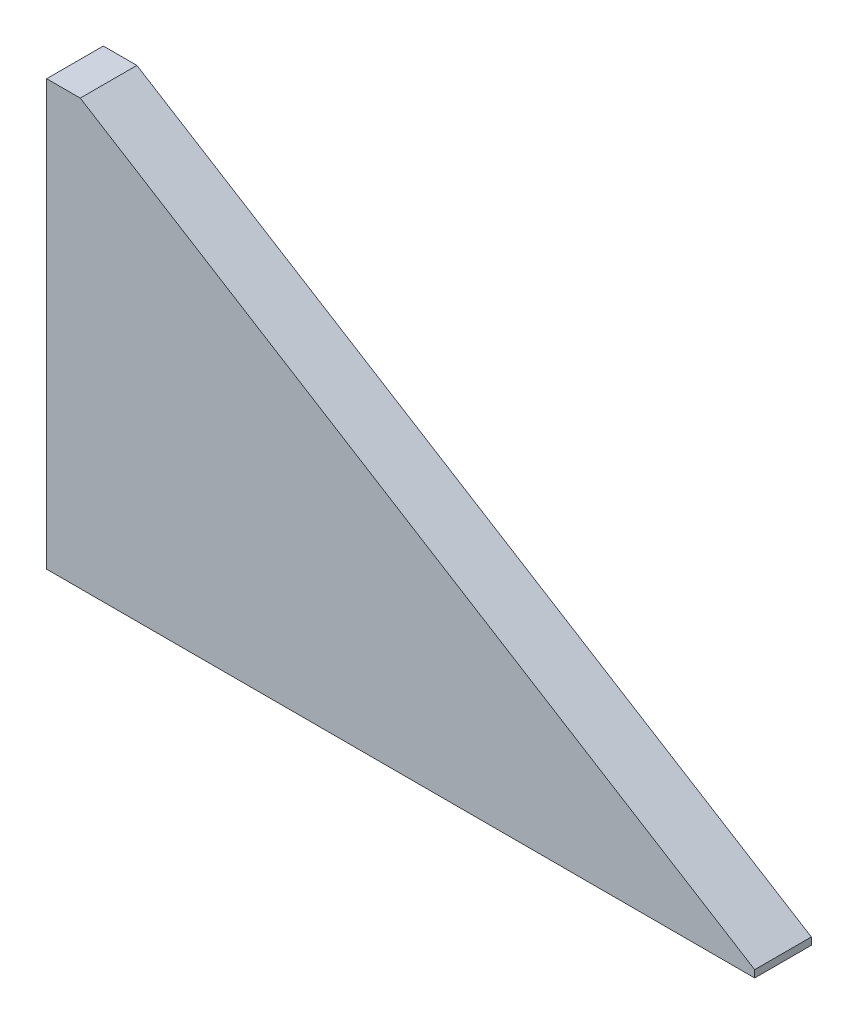
ISO-10303-21;
HEADER;
FILE_DESCRIPTION(('STEP AP214'),'2;1');
FILE_NAME('part.step','',(''),(''),'','','');
FILE_SCHEMA(('AUTOMOTIVE_DESIGN { 1 0 10303 214 1 1 1 1 }'));
ENDSEC;
DATA;
#1=APPLICATION_CONTEXT('core data for automotive mechanical design processes');
#2=APPLICATION_PROTOCOL_DEFINITION('international standard','automotive_design',2000,#1);
#3=PRODUCT_CONTEXT('',#1,'mechanical');
#4=PRODUCT('Part','Part','',(#3));
#5=PRODUCT_RELATED_PRODUCT_CATEGORY('part','',(#4));
#6=PRODUCT_DEFINITION_FORMATION('','',#4);
#7=PRODUCT_DEFINITION_CONTEXT('part definition',#1,'design');
#8=PRODUCT_DEFINITION('design','',#6,#7);
#9=PRODUCT_DEFINITION_SHAPE('','',#8);
#10=(LENGTH_UNIT() NAMED_UNIT(*) SI_UNIT(.MILLI.,.METRE.));
#11=(NAMED_UNIT(*) PLANE_ANGLE_UNIT() SI_UNIT($,.RADIAN.));
#12=(NAMED_UNIT(*) SI_UNIT($,.STERADIAN.) SOLID_ANGLE_UNIT());
#13=UNCERTAINTY_MEASURE_WITH_UNIT(LENGTH_MEASURE(1.E-05),#10,'distance_accuracy_value','');
#14=(GEOMETRIC_REPRESENTATION_CONTEXT(3) GLOBAL_UNCERTAINTY_ASSIGNED_CONTEXT((#13)) GLOBAL_UNIT_ASSIGNED_CONTEXT((#10,
#11,#12)) REPRESENTATION_CONTEXT('',''));
#15=CARTESIAN_POINT('',(0.,0.,0.));
#16=DIRECTION('',(0.,0.,1.));
#17=DIRECTION('',(1.,0.,0.));
#18=AXIS2_PLACEMENT_3D('',#15,#16,#17);
#19=CARTESIAN_POINT('',(-100.,59.1045518477182,4.85436997324983));
#20=DIRECTION('',(0.,0.,1.));
#21=DIRECTION('',(0.,-1.,0.));
#22=AXIS2_PLACEMENT_3D('',#19,#20,#21);
#23=PLANE('',#22);
#24=DIRECTION('',(0.85023417339282,-0.52640464511156,0.));
#25=VECTOR('',#24,1.);
#26=CARTESIAN_POINT('',(-96.,59.5638387079138,4.85436997324982));
#27=LINE('',#26,#25);
#28=CARTESIAN_POINT('',(-95.258172610073,59.1045518477182,4.85436997324983));
#29=VERTEX_POINT('',#28);
#30=CARTESIAN_POINT('',(0.,0.127453401201356,4.85436997324982));
#31=VERTEX_POINT('',#30);
#32=EDGE_CURVE('E48',#29,#31,#27,.T.);
#33=ORIENTED_EDGE('',*,*,#32,.F.);
#34=DIRECTION('',(1.,0.,0.));
#35=VECTOR('',#34,1.);
#36=CARTESIAN_POINT('',(-100.,59.1045518477182,4.85436997324983));
#37=LINE('',#36,#35);
#38=CARTESIAN_POINT('',(-100.,59.1045518477182,4.85436997324983));
#39=VERTEX_POINT('',#38);
#40=EDGE_CURVE('E11',#39,#29,#37,.T.);
#41=ORIENTED_EDGE('',*,*,#40,.F.);
#42=DIRECTION('',(0.,-1.,0.));
#43=VECTOR('',#42,1.);
#44=CARTESIAN_POINT('',(-100.,59.1045518477182,4.85436997324983));
#45=LINE('',#44,#43);
#46=CARTESIAN_POINT('',(-100.,-0.895448152281778,4.85436997324982));
#47=VERTEX_POINT('',#46);
#48=EDGE_CURVE('E103',#39,#47,#45,.T.);
#49=ORIENTED_EDGE('',*,*,#48,.T.);
#50=DIRECTION('',(1.,0.,0.));
#51=VECTOR('',#50,1.);
#52=CARTESIAN_POINT('',(-100.,-0.895448152281778,4.85436997324982));
#53=LINE('',#52,#51);
#54=CARTESIAN_POINT('',(0.,-0.895448152281778,4.85436997324982));
#55=VERTEX_POINT('',#54);
#56=EDGE_CURVE('E35',#47,#55,#53,.T.);
#57=ORIENTED_EDGE('',*,*,#56,.T.);
#58=DIRECTION('',(0.,-1.,0.));
#59=VECTOR('',#58,1.);
#60=CARTESIAN_POINT('',(0.,59.1045518477182,4.85436997324983));
#61=LINE('',#60,#59);
#62=EDGE_CURVE('E99',#31,#55,#61,.T.);
#63=ORIENTED_EDGE('',*,*,#62,.F.);
#64=EDGE_LOOP('',(#33,#41,#49,#57,#63));
#65=FACE_BOUND('',#64,.T.);
#66=ADVANCED_FACE('F32',(#65),#23,.T.);
#67=CARTESIAN_POINT('',(-100.,59.1045518477182,4.85436997324983));
#68=DIRECTION('',(0.,1.,0.));
#69=DIRECTION('',(0.,0.,1.));
#70=AXIS2_PLACEMENT_3D('',#67,#68,#69);
#71=PLANE('',#70);
#72=DIRECTION('',(0.,0.,-1.));
#73=VECTOR('',#72,1.);
#74=CARTESIAN_POINT('',(-95.258172610073,59.1045518477182,-3.14663002675018));
#75=LINE('',#74,#73);
#76=CARTESIAN_POINT('',(-95.258172610073,59.1045518477182,-3.14563002675017));
#77=VERTEX_POINT('',#76);
#78=EDGE_CURVE('E91',#29,#77,#75,.T.);
#79=ORIENTED_EDGE('',*,*,#78,.T.);
#80=DIRECTION('',(1.,0.,0.));
#81=VECTOR('',#80,1.);
#82=CARTESIAN_POINT('',(-100.,59.1045518477182,-3.14563002675017));
#83=LINE('',#82,#81);
#84=CARTESIAN_POINT('',(-100.,59.1045518477182,-3.14563002675017));
#85=VERTEX_POINT('',#84);
#86=EDGE_CURVE('E40',#85,#77,#83,.T.);
#87=ORIENTED_EDGE('',*,*,#86,.F.);
#88=DIRECTION('',(0.,0.,1.));
#89=VECTOR('',#88,1.);
#90=CARTESIAN_POINT('',(-100.,59.1045518477182,4.85436997324983));
#91=LINE('',#90,#89);
#92=EDGE_CURVE('E110',#85,#39,#91,.T.);
#93=ORIENTED_EDGE('',*,*,#92,.T.);
#94=ORIENTED_EDGE('',*,*,#40,.T.);
#95=EDGE_LOOP('',(#79,#87,#93,#94));
#96=FACE_BOUND('',#95,.T.);
#97=ADVANCED_FACE('F119',(#96),#71,.T.);
#98=CARTESIAN_POINT('',(-100.,59.1045518477182,-3.14563002675017));
#99=DIRECTION('',(0.,0.,-1.));
#100=DIRECTION('',(0.,1.,0.));
#101=AXIS2_PLACEMENT_3D('',#98,#99,#100);
#102=PLANE('',#101);
#103=DIRECTION('',(0.85023417339282,-0.52640464511156,0.));
#104=VECTOR('',#103,1.);
#105=CARTESIAN_POINT('',(-96.,59.5638387079138,-3.14563002675017));
#106=LINE('',#105,#104);
#107=CARTESIAN_POINT('',(0.,0.127453401201356,-3.14563002675018));
#108=VERTEX_POINT('',#107);
#109=EDGE_CURVE('E86',#77,#108,#106,.T.);
#110=ORIENTED_EDGE('',*,*,#109,.T.);
#111=DIRECTION('',(0.,1.,0.));
#112=VECTOR('',#111,1.);
#113=CARTESIAN_POINT('',(0.,59.1045518477182,-3.14563002675017));
#114=LINE('',#113,#112);
#115=CARTESIAN_POINT('',(0.,-0.895448152281778,-3.14563002675018));
#116=VERTEX_POINT('',#115);
#117=EDGE_CURVE('E96',#116,#108,#114,.T.);
#118=ORIENTED_EDGE('',*,*,#117,.F.);
#119=DIRECTION('',(1.,0.,0.));
#120=VECTOR('',#119,1.);
#121=CARTESIAN_POINT('',(-100.,-0.895448152281778,-3.14563002675018));
#122=LINE('',#121,#120);
#123=CARTESIAN_POINT('',(-100.,-0.895448152281778,-3.14563002675018));
#124=VERTEX_POINT('',#123);
#125=EDGE_CURVE('E71',#124,#116,#122,.T.);
#126=ORIENTED_EDGE('',*,*,#125,.F.);
#127=DIRECTION('',(0.,1.,0.));
#128=VECTOR('',#127,1.);
#129=CARTESIAN_POINT('',(-100.,59.1045518477182,-3.14563002675017));
#130=LINE('',#129,#128);
#131=EDGE_CURVE('E112',#124,#85,#130,.T.);
#132=ORIENTED_EDGE('',*,*,#131,.T.);
#133=ORIENTED_EDGE('',*,*,#86,.T.);
#134=EDGE_LOOP('',(#110,#118,#126,#132,#133));
#135=FACE_BOUND('',#134,.T.);
#136=ADVANCED_FACE('F95',(#135),#102,.T.);
#137=CARTESIAN_POINT('',(-100.,-0.895448152281778,4.85436997324982));
#138=DIRECTION('',(0.,-1.,0.));
#139=DIRECTION('',(0.,0.,-1.));
#140=AXIS2_PLACEMENT_3D('',#137,#138,#139);
#141=PLANE('',#140);
#142=DIRECTION('',(0.,0.,-1.));
#143=VECTOR('',#142,1.);
#144=CARTESIAN_POINT('',(0.,-0.895448152281778,4.85436997324982));
#145=LINE('',#144,#143);
#146=EDGE_CURVE('E102',#55,#116,#145,.T.);
#147=ORIENTED_EDGE('',*,*,#146,.F.);
#148=ORIENTED_EDGE('',*,*,#56,.F.);
#149=DIRECTION('',(0.,0.,-1.));
#150=VECTOR('',#149,1.);
#151=CARTESIAN_POINT('',(-100.,-0.895448152281778,4.85436997324982));
#152=LINE('',#151,#150);
#153=EDGE_CURVE('E105',#47,#124,#152,.T.);
#154=ORIENTED_EDGE('',*,*,#153,.T.);
#155=ORIENTED_EDGE('',*,*,#125,.T.);
#156=EDGE_LOOP('',(#147,#148,#154,#155));
#157=FACE_BOUND('',#156,.T.);
#158=ADVANCED_FACE('F121',(#157),#141,.T.);
#159=CARTESIAN_POINT('',(-100.,0.,0.));
#160=DIRECTION('',(1.,0.,0.));
#161=DIRECTION('',(0.,0.,-1.));
#162=AXIS2_PLACEMENT_3D('',#159,#160,#161);
#163=PLANE('',#162);
#164=ORIENTED_EDGE('',*,*,#48,.F.);
#165=ORIENTED_EDGE('',*,*,#92,.F.);
#166=ORIENTED_EDGE('',*,*,#131,.F.);
#167=ORIENTED_EDGE('',*,*,#153,.F.);
#168=EDGE_LOOP('',(#164,#165,#166,#167));
#169=FACE_BOUND('',#168,.T.);
#170=ADVANCED_FACE('F124',(#169),#163,.F.);
#171=CARTESIAN_POINT('',(0.,0.,0.));
#172=DIRECTION('',(1.,0.,0.));
#173=DIRECTION('',(0.,0.,-1.));
#174=AXIS2_PLACEMENT_3D('',#171,#172,#173);
#175=PLANE('',#174);
#176=DIRECTION('',(0.,0.,1.));
#177=VECTOR('',#176,1.);
#178=CARTESIAN_POINT('',(0.,0.127453401201356,-3.14663002675018));
#179=LINE('',#178,#177);
#180=EDGE_CURVE('E83',#108,#31,#179,.T.);
#181=ORIENTED_EDGE('',*,*,#180,.T.);
#182=ORIENTED_EDGE('',*,*,#62,.T.);
#183=ORIENTED_EDGE('',*,*,#146,.T.);
#184=ORIENTED_EDGE('',*,*,#117,.T.);
#185=EDGE_LOOP('',(#181,#182,#183,#184));
#186=FACE_BOUND('',#185,.T.);
#187=ADVANCED_FACE('F101',(#186),#175,.T.);
#188=CARTESIAN_POINT('',(-96.,59.5638387079138,-3.14663002675018));
#189=DIRECTION('',(-0.52640464511156,-0.85023417339282,0.));
#190=DIRECTION('',(0.85023417339282,-0.52640464511156,0.));
#191=AXIS2_PLACEMENT_3D('',#188,#189,#190);
#192=PLANE('',#191);
#193=ORIENTED_EDGE('',*,*,#32,.T.);
#194=ORIENTED_EDGE('',*,*,#180,.F.);
#195=ORIENTED_EDGE('',*,*,#109,.F.);
#196=ORIENTED_EDGE('',*,*,#78,.F.);
#197=EDGE_LOOP('',(#193,#194,#195,#196));
#198=FACE_BOUND('',#197,.T.);
#199=ADVANCED_FACE('F85',(#198),#192,.F.);
#200=CLOSED_SHELL('',(#66,#97,#136,#158,#170,#187,#199));
#201=MANIFOLD_SOLID_BREP('B2',#200);
#202=ADVANCED_BREP_SHAPE_REPRESENTATION('',(#18,#201),#14);
#203=SHAPE_DEFINITION_REPRESENTATION(#9,#202);
ENDSEC;
END-ISO-10303-21;
